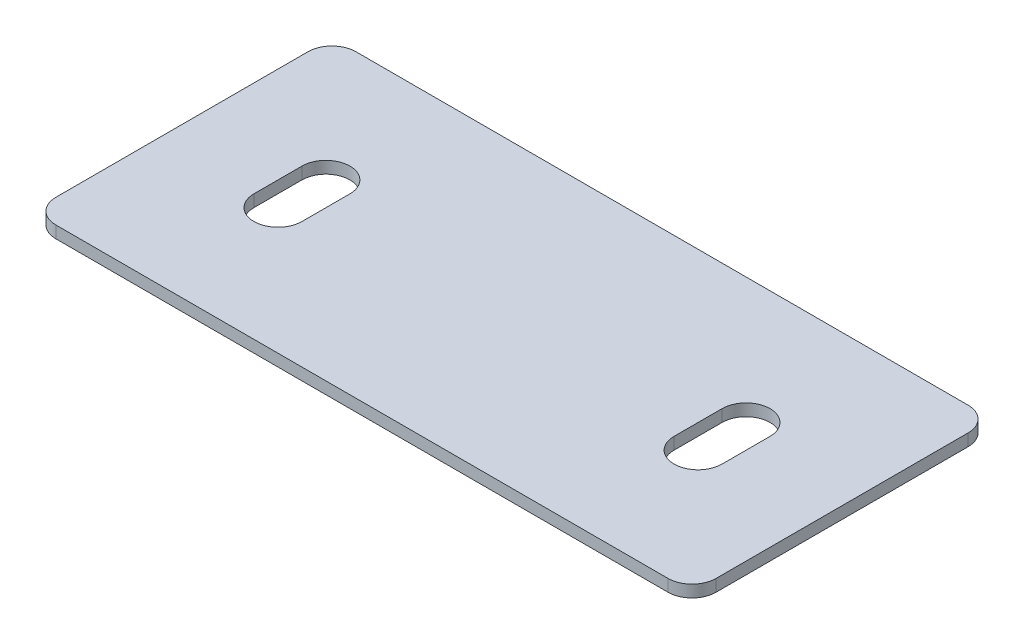
ISO-10303-21;
HEADER;
FILE_DESCRIPTION(('STEP AP214'),'2;1');
FILE_NAME('part.step','',(''),(''),'','','');
FILE_SCHEMA(('AUTOMOTIVE_DESIGN { 1 0 10303 214 1 1 1 1 }'));
ENDSEC;
DATA;
#1=APPLICATION_CONTEXT('core data for automotive mechanical design processes');
#2=APPLICATION_PROTOCOL_DEFINITION('international standard','automotive_design',2000,#1);
#3=PRODUCT_CONTEXT('',#1,'mechanical');
#4=PRODUCT('Part','Part','',(#3));
#5=PRODUCT_RELATED_PRODUCT_CATEGORY('part','',(#4));
#6=PRODUCT_DEFINITION_FORMATION('','',#4);
#7=PRODUCT_DEFINITION_CONTEXT('part definition',#1,'design');
#8=PRODUCT_DEFINITION('design','',#6,#7);
#9=PRODUCT_DEFINITION_SHAPE('','',#8);
#10=(LENGTH_UNIT() NAMED_UNIT(*) SI_UNIT(.MILLI.,.METRE.));
#11=(NAMED_UNIT(*) PLANE_ANGLE_UNIT() SI_UNIT($,.RADIAN.));
#12=(NAMED_UNIT(*) SI_UNIT($,.STERADIAN.) SOLID_ANGLE_UNIT());
#13=UNCERTAINTY_MEASURE_WITH_UNIT(LENGTH_MEASURE(1.E-05),#10,'distance_accuracy_value','');
#14=(GEOMETRIC_REPRESENTATION_CONTEXT(3) GLOBAL_UNCERTAINTY_ASSIGNED_CONTEXT((#13)) GLOBAL_UNIT_ASSIGNED_CONTEXT((#10,
#11,#12)) REPRESENTATION_CONTEXT('',''));
#15=CARTESIAN_POINT('',(0.,0.,0.));
#16=DIRECTION('',(0.,0.,1.));
#17=DIRECTION('',(1.,0.,0.));
#18=AXIS2_PLACEMENT_3D('',#15,#16,#17);
#19=CARTESIAN_POINT('',(0.,1.,0.));
#20=DIRECTION('',(0.,1.,0.));
#21=DIRECTION('',(0.,0.,1.));
#22=AXIS2_PLACEMENT_3D('',#19,#20,#21);
#23=PLANE('',#22);
#24=DIRECTION('',(0.,0.,1.));
#25=VECTOR('',#24,1.);
#26=CARTESIAN_POINT('',(-30.2182697593582,1.,-12.7126572133864));
#27=LINE('',#26,#25);
#28=CARTESIAN_POINT('',(-30.2182697593582,1.,-10.7126572133864));
#29=VERTEX_POINT('',#28);
#30=CARTESIAN_POINT('',(-30.2182697593582,1.,10.2873427866136));
#31=VERTEX_POINT('',#30);
#32=EDGE_CURVE('E227',#29,#31,#27,.T.);
#33=ORIENTED_EDGE('',*,*,#32,.T.);
#34=CARTESIAN_POINT('',(-28.2182697593582,1.,10.2873427866136));
#35=DIRECTION('',(0.,1.,0.));
#36=DIRECTION('',(0.,0.,1.));
#37=AXIS2_PLACEMENT_3D('',#34,#35,#36);
#38=CIRCLE('',#37,2.);
#39=CARTESIAN_POINT('',(-28.2182697593582,1.,12.2873427866136));
#40=VERTEX_POINT('',#39);
#41=EDGE_CURVE('E265',#31,#40,#38,.T.);
#42=ORIENTED_EDGE('',*,*,#41,.T.);
#43=DIRECTION('',(1.,0.,0.));
#44=VECTOR('',#43,1.);
#45=CARTESIAN_POINT('',(-30.2182697593582,1.,12.2873427866136));
#46=LINE('',#45,#44);
#47=CARTESIAN_POINT('',(22.7817302406418,1.,12.2873427866136));
#48=VERTEX_POINT('',#47);
#49=EDGE_CURVE('E230',#40,#48,#46,.T.);
#50=ORIENTED_EDGE('',*,*,#49,.T.);
#51=CARTESIAN_POINT('',(22.7817302406418,1.,10.2873427866136));
#52=DIRECTION('',(0.,1.,0.));
#53=DIRECTION('',(0.,0.,1.));
#54=AXIS2_PLACEMENT_3D('',#51,#52,#53);
#55=CIRCLE('',#54,2.);
#56=CARTESIAN_POINT('',(24.7817302406418,1.,10.2873427866136));
#57=VERTEX_POINT('',#56);
#58=EDGE_CURVE('E260',#48,#57,#55,.T.);
#59=ORIENTED_EDGE('',*,*,#58,.T.);
#60=DIRECTION('',(0.,0.,-1.));
#61=VECTOR('',#60,1.);
#62=CARTESIAN_POINT('',(24.7817302406418,1.,-12.7126572133864));
#63=LINE('',#62,#61);
#64=CARTESIAN_POINT('',(24.7817302406418,1.,-10.7126572133864));
#65=VERTEX_POINT('',#64);
#66=EDGE_CURVE('E222',#57,#65,#63,.T.);
#67=ORIENTED_EDGE('',*,*,#66,.T.);
#68=CARTESIAN_POINT('',(22.7817302406418,1.,-10.7126572133864));
#69=DIRECTION('',(0.,1.,0.));
#70=DIRECTION('',(0.,0.,1.));
#71=AXIS2_PLACEMENT_3D('',#68,#69,#70);
#72=CIRCLE('',#71,2.);
#73=CARTESIAN_POINT('',(22.7817302406418,1.,-12.7126572133864));
#74=VERTEX_POINT('',#73);
#75=EDGE_CURVE('E57',#65,#74,#72,.T.);
#76=ORIENTED_EDGE('',*,*,#75,.T.);
#77=DIRECTION('',(-1.,0.,0.));
#78=VECTOR('',#77,1.);
#79=CARTESIAN_POINT('',(-30.2182697593582,1.,-12.7126572133864));
#80=LINE('',#79,#78);
#81=CARTESIAN_POINT('',(-28.2182697593582,1.,-12.7126572133864));
#82=VERTEX_POINT('',#81);
#83=EDGE_CURVE('E224',#74,#82,#80,.T.);
#84=ORIENTED_EDGE('',*,*,#83,.T.);
#85=CARTESIAN_POINT('',(-28.2182697593582,1.,-10.7126572133864));
#86=DIRECTION('',(0.,1.,0.));
#87=DIRECTION('',(0.,0.,1.));
#88=AXIS2_PLACEMENT_3D('',#85,#86,#87);
#89=CIRCLE('',#88,2.);
#90=EDGE_CURVE('E263',#82,#29,#89,.T.);
#91=ORIENTED_EDGE('',*,*,#90,.T.);
#92=EDGE_LOOP('',(#33,#42,#50,#59,#67,#76,#84,#91));
#93=FACE_BOUND('',#92,.T.);
#94=DIRECTION('',(0.,0.,1.));
#95=VECTOR('',#94,1.);
#96=CARTESIAN_POINT('',(-22.2182697593582,1.,-2.21265721338636));
#97=LINE('',#96,#95);
#98=CARTESIAN_POINT('',(-22.2182697593582,1.,-2.21265721338636));
#99=VERTEX_POINT('',#98);
#100=CARTESIAN_POINT('',(-22.2182697593582,1.,1.78734278661363));
#101=VERTEX_POINT('',#100);
#102=EDGE_CURVE('E193',#99,#101,#97,.T.);
#103=ORIENTED_EDGE('',*,*,#102,.F.);
#104=CARTESIAN_POINT('',(-20.2182697593582,1.,-2.21265721338637));
#105=DIRECTION('',(0.,1.,0.));
#106=DIRECTION('',(0.,0.,1.));
#107=AXIS2_PLACEMENT_3D('',#104,#105,#106);
#108=CIRCLE('',#107,2.00000000000001);
#109=CARTESIAN_POINT('',(-18.2182697593582,1.,-2.21265721338637));
#110=VERTEX_POINT('',#109);
#111=EDGE_CURVE('E191',#110,#99,#108,.T.);
#112=ORIENTED_EDGE('',*,*,#111,.F.);
#113=DIRECTION('',(0.,0.,-1.));
#114=VECTOR('',#113,1.);
#115=CARTESIAN_POINT('',(-18.2182697593582,1.,-2.21265721338637));
#116=LINE('',#115,#114);
#117=CARTESIAN_POINT('',(-18.2182697593582,1.,1.78734278661364));
#118=VERTEX_POINT('',#117);
#119=EDGE_CURVE('E199',#118,#110,#116,.T.);
#120=ORIENTED_EDGE('',*,*,#119,.F.);
#121=CARTESIAN_POINT('',(-20.2182697593582,1.,1.78734278661365));
#122=DIRECTION('',(0.,1.,0.));
#123=DIRECTION('',(0.,0.,1.));
#124=AXIS2_PLACEMENT_3D('',#121,#122,#123);
#125=CIRCLE('',#124,2.00000000000001);
#126=EDGE_CURVE('E196',#101,#118,#125,.T.);
#127=ORIENTED_EDGE('',*,*,#126,.F.);
#128=EDGE_LOOP('',(#103,#112,#120,#127));
#129=FACE_BOUND('',#128,.T.);
#130=DIRECTION('',(0.,0.,1.));
#131=VECTOR('',#130,1.);
#132=CARTESIAN_POINT('',(12.7817302406417,1.,-2.21265721338637));
#133=LINE('',#132,#131);
#134=CARTESIAN_POINT('',(12.7817302406417,1.,-2.21265721338637));
#135=VERTEX_POINT('',#134);
#136=CARTESIAN_POINT('',(12.7817302406417,1.,1.78734278661363));
#137=VERTEX_POINT('',#136);
#138=EDGE_CURVE('E160',#135,#137,#133,.T.);
#139=ORIENTED_EDGE('',*,*,#138,.F.);
#140=CARTESIAN_POINT('',(14.7817302406418,1.,-2.21265721338637));
#141=DIRECTION('',(0.,1.,0.));
#142=DIRECTION('',(0.,0.,-1.));
#143=AXIS2_PLACEMENT_3D('',#140,#141,#142);
#144=CIRCLE('',#143,2.00000000000001);
#145=CARTESIAN_POINT('',(16.7817302406418,1.,-2.21265721338637));
#146=VERTEX_POINT('',#145);
#147=EDGE_CURVE('E150',#146,#135,#144,.T.);
#148=ORIENTED_EDGE('',*,*,#147,.F.);
#149=DIRECTION('',(0.,0.,-1.));
#150=VECTOR('',#149,1.);
#151=CARTESIAN_POINT('',(16.7817302406418,1.,-2.21265721338637));
#152=LINE('',#151,#150);
#153=CARTESIAN_POINT('',(16.7817302406418,1.,1.78734278661363));
#154=VERTEX_POINT('',#153);
#155=EDGE_CURVE('E175',#154,#146,#152,.T.);
#156=ORIENTED_EDGE('',*,*,#155,.F.);
#157=CARTESIAN_POINT('',(14.7817302406418,1.,1.78734278661363));
#158=DIRECTION('',(0.,1.,0.));
#159=DIRECTION('',(0.,0.,-1.));
#160=AXIS2_PLACEMENT_3D('',#157,#158,#159);
#161=CIRCLE('',#160,2.00000000000001);
#162=EDGE_CURVE('E173',#137,#154,#161,.T.);
#163=ORIENTED_EDGE('',*,*,#162,.F.);
#164=EDGE_LOOP('',(#139,#148,#156,#163));
#165=FACE_BOUND('',#164,.T.);
#166=ADVANCED_FACE('F35',(#93,#129,#165),#23,.T.);
#167=CARTESIAN_POINT('',(0.,0.,0.));
#168=DIRECTION('',(0.,1.,0.));
#169=DIRECTION('',(0.,0.,1.));
#170=AXIS2_PLACEMENT_3D('',#167,#168,#169);
#171=PLANE('',#170);
#172=CARTESIAN_POINT('',(-20.2182697593582,0.,-2.21265721338637));
#173=DIRECTION('',(0.,1.,0.));
#174=DIRECTION('',(0.,0.,1.));
#175=AXIS2_PLACEMENT_3D('',#172,#173,#174);
#176=CIRCLE('',#175,2.00000000000001);
#177=CARTESIAN_POINT('',(-18.2182697593582,0.,-2.21265721338637));
#178=VERTEX_POINT('',#177);
#179=CARTESIAN_POINT('',(-22.2182697593582,0.,-2.21265721338636));
#180=VERTEX_POINT('',#179);
#181=EDGE_CURVE('E168',#178,#180,#176,.T.);
#182=ORIENTED_EDGE('',*,*,#181,.T.);
#183=DIRECTION('',(0.,0.,1.));
#184=VECTOR('',#183,1.);
#185=CARTESIAN_POINT('',(-22.2182697593582,0.,-2.21265721338636));
#186=LINE('',#185,#184);
#187=CARTESIAN_POINT('',(-22.2182697593582,0.,1.78734278661363));
#188=VERTEX_POINT('',#187);
#189=EDGE_CURVE('E204',#180,#188,#186,.T.);
#190=ORIENTED_EDGE('',*,*,#189,.T.);
#191=CARTESIAN_POINT('',(-20.2182697593582,0.,1.78734278661365));
#192=DIRECTION('',(0.,1.,0.));
#193=DIRECTION('',(0.,0.,1.));
#194=AXIS2_PLACEMENT_3D('',#191,#192,#193);
#195=CIRCLE('',#194,2.00000000000001);
#196=CARTESIAN_POINT('',(-18.2182697593582,0.,1.78734278661364));
#197=VERTEX_POINT('',#196);
#198=EDGE_CURVE('E207',#188,#197,#195,.T.);
#199=ORIENTED_EDGE('',*,*,#198,.T.);
#200=DIRECTION('',(0.,0.,-1.));
#201=VECTOR('',#200,1.);
#202=CARTESIAN_POINT('',(-18.2182697593582,0.,-2.21265721338637));
#203=LINE('',#202,#201);
#204=EDGE_CURVE('E194',#197,#178,#203,.T.);
#205=ORIENTED_EDGE('',*,*,#204,.T.);
#206=EDGE_LOOP('',(#182,#190,#199,#205));
#207=FACE_BOUND('',#206,.T.);
#208=DIRECTION('',(1.,0.,0.));
#209=VECTOR('',#208,1.);
#210=CARTESIAN_POINT('',(-30.2182697593582,0.,12.2873427866136));
#211=LINE('',#210,#209);
#212=CARTESIAN_POINT('',(-28.2182697593582,0.,12.2873427866136));
#213=VERTEX_POINT('',#212);
#214=CARTESIAN_POINT('',(22.7817302406418,0.,12.2873427866136));
#215=VERTEX_POINT('',#214);
#216=EDGE_CURVE('E225',#213,#215,#211,.T.);
#217=ORIENTED_EDGE('',*,*,#216,.F.);
#218=CARTESIAN_POINT('',(-28.2182697593582,0.,10.2873427866136));
#219=DIRECTION('',(0.,1.,0.));
#220=DIRECTION('',(0.,0.,1.));
#221=AXIS2_PLACEMENT_3D('',#218,#219,#220);
#222=CIRCLE('',#221,2.);
#223=CARTESIAN_POINT('',(-30.2182697593582,0.,10.2873427866136));
#224=VERTEX_POINT('',#223);
#225=EDGE_CURVE('E253',#213,#224,#222,.F.);
#226=ORIENTED_EDGE('',*,*,#225,.T.);
#227=DIRECTION('',(0.,0.,1.));
#228=VECTOR('',#227,1.);
#229=CARTESIAN_POINT('',(-30.2182697593582,0.,-12.7126572133864));
#230=LINE('',#229,#228);
#231=CARTESIAN_POINT('',(-30.2182697593582,0.,-10.7126572133864));
#232=VERTEX_POINT('',#231);
#233=EDGE_CURVE('E238',#232,#224,#230,.T.);
#234=ORIENTED_EDGE('',*,*,#233,.F.);
#235=CARTESIAN_POINT('',(-28.2182697593582,0.,-10.7126572133864));
#236=DIRECTION('',(0.,1.,0.));
#237=DIRECTION('',(0.,0.,1.));
#238=AXIS2_PLACEMENT_3D('',#235,#236,#237);
#239=CIRCLE('',#238,2.);
#240=CARTESIAN_POINT('',(-28.2182697593582,0.,-12.7126572133864));
#241=VERTEX_POINT('',#240);
#242=EDGE_CURVE('E251',#232,#241,#239,.F.);
#243=ORIENTED_EDGE('',*,*,#242,.T.);
#244=DIRECTION('',(-1.,0.,0.));
#245=VECTOR('',#244,1.);
#246=CARTESIAN_POINT('',(-30.2182697593582,0.,-12.7126572133864));
#247=LINE('',#246,#245);
#248=CARTESIAN_POINT('',(22.7817302406418,0.,-12.7126572133864));
#249=VERTEX_POINT('',#248);
#250=EDGE_CURVE('E236',#249,#241,#247,.T.);
#251=ORIENTED_EDGE('',*,*,#250,.F.);
#252=CARTESIAN_POINT('',(22.7817302406418,0.,-10.7126572133864));
#253=DIRECTION('',(0.,1.,0.));
#254=DIRECTION('',(0.,0.,1.));
#255=AXIS2_PLACEMENT_3D('',#252,#253,#254);
#256=CIRCLE('',#255,2.);
#257=CARTESIAN_POINT('',(24.7817302406418,0.,-10.7126572133864));
#258=VERTEX_POINT('',#257);
#259=EDGE_CURVE('E249',#249,#258,#256,.F.);
#260=ORIENTED_EDGE('',*,*,#259,.T.);
#261=DIRECTION('',(0.,0.,-1.));
#262=VECTOR('',#261,1.);
#263=CARTESIAN_POINT('',(24.7817302406418,0.,-12.7126572133864));
#264=LINE('',#263,#262);
#265=CARTESIAN_POINT('',(24.7817302406418,0.,10.2873427866136));
#266=VERTEX_POINT('',#265);
#267=EDGE_CURVE('E221',#266,#258,#264,.T.);
#268=ORIENTED_EDGE('',*,*,#267,.F.);
#269=CARTESIAN_POINT('',(22.7817302406418,0.,10.2873427866136));
#270=DIRECTION('',(0.,1.,0.));
#271=DIRECTION('',(0.,0.,1.));
#272=AXIS2_PLACEMENT_3D('',#269,#270,#271);
#273=CIRCLE('',#272,2.);
#274=EDGE_CURVE('E247',#266,#215,#273,.F.);
#275=ORIENTED_EDGE('',*,*,#274,.T.);
#276=EDGE_LOOP('',(#217,#226,#234,#243,#251,#260,#268,#275));
#277=FACE_BOUND('',#276,.T.);
#278=CARTESIAN_POINT('',(14.7817302406418,0.,-2.21265721338637));
#279=DIRECTION('',(0.,1.,0.));
#280=DIRECTION('',(0.,0.,-1.));
#281=AXIS2_PLACEMENT_3D('',#278,#279,#280);
#282=CIRCLE('',#281,2.00000000000001);
#283=CARTESIAN_POINT('',(16.7817302406418,0.,-2.21265721338637));
#284=VERTEX_POINT('',#283);
#285=CARTESIAN_POINT('',(12.7817302406417,0.,-2.21265721338637));
#286=VERTEX_POINT('',#285);
#287=EDGE_CURVE('E179',#284,#286,#282,.T.);
#288=ORIENTED_EDGE('',*,*,#287,.T.);
#289=DIRECTION('',(0.,0.,1.));
#290=VECTOR('',#289,1.);
#291=CARTESIAN_POINT('',(12.7817302406417,0.,-2.21265721338637));
#292=LINE('',#291,#290);
#293=CARTESIAN_POINT('',(12.7817302406417,0.,1.78734278661363));
#294=VERTEX_POINT('',#293);
#295=EDGE_CURVE('E167',#286,#294,#292,.T.);
#296=ORIENTED_EDGE('',*,*,#295,.T.);
#297=CARTESIAN_POINT('',(14.7817302406418,0.,1.78734278661363));
#298=DIRECTION('',(0.,1.,0.));
#299=DIRECTION('',(0.,0.,-1.));
#300=AXIS2_PLACEMENT_3D('',#297,#298,#299);
#301=CIRCLE('',#300,2.00000000000001);
#302=CARTESIAN_POINT('',(16.7817302406418,0.,1.78734278661363));
#303=VERTEX_POINT('',#302);
#304=EDGE_CURVE('E182',#294,#303,#301,.T.);
#305=ORIENTED_EDGE('',*,*,#304,.T.);
#306=DIRECTION('',(0.,0.,-1.));
#307=VECTOR('',#306,1.);
#308=CARTESIAN_POINT('',(16.7817302406418,0.,-2.21265721338637));
#309=LINE('',#308,#307);
#310=EDGE_CURVE('E161',#303,#284,#309,.T.);
#311=ORIENTED_EDGE('',*,*,#310,.T.);
#312=EDGE_LOOP('',(#288,#296,#305,#311));
#313=FACE_BOUND('',#312,.T.);
#314=ADVANCED_FACE('F281',(#207,#277,#313),#171,.F.);
#315=CARTESIAN_POINT('',(24.7817302406418,1.,-12.7126572133864));
#316=DIRECTION('',(-1.,0.,0.));
#317=DIRECTION('',(0.,0.,1.));
#318=AXIS2_PLACEMENT_3D('',#315,#316,#317);
#319=PLANE('',#318);
#320=ORIENTED_EDGE('',*,*,#267,.T.);
#321=DIRECTION('',(0.,-1.,0.));
#322=VECTOR('',#321,1.);
#323=CARTESIAN_POINT('',(24.7817302406418,1.,-10.7126572133864));
#324=LINE('',#323,#322);
#325=EDGE_CURVE('E11',#258,#65,#324,.F.);
#326=ORIENTED_EDGE('',*,*,#325,.T.);
#327=ORIENTED_EDGE('',*,*,#66,.F.);
#328=DIRECTION('',(0.,-1.,0.));
#329=VECTOR('',#328,1.);
#330=CARTESIAN_POINT('',(24.7817302406418,1.,10.2873427866136));
#331=LINE('',#330,#329);
#332=EDGE_CURVE('E43',#57,#266,#331,.T.);
#333=ORIENTED_EDGE('',*,*,#332,.T.);
#334=EDGE_LOOP('',(#320,#326,#327,#333));
#335=FACE_BOUND('',#334,.T.);
#336=ADVANCED_FACE('F275',(#335),#319,.F.);
#337=CARTESIAN_POINT('',(-30.2182697593582,1.,-12.7126572133864));
#338=DIRECTION('',(0.,0.,1.));
#339=DIRECTION('',(1.,0.,0.));
#340=AXIS2_PLACEMENT_3D('',#337,#338,#339);
#341=PLANE('',#340);
#342=ORIENTED_EDGE('',*,*,#250,.T.);
#343=DIRECTION('',(0.,-1.,0.));
#344=VECTOR('',#343,1.);
#345=CARTESIAN_POINT('',(-28.2182697593582,1.,-12.7126572133864));
#346=LINE('',#345,#344);
#347=EDGE_CURVE('E50',#241,#82,#346,.F.);
#348=ORIENTED_EDGE('',*,*,#347,.T.);
#349=ORIENTED_EDGE('',*,*,#83,.F.);
#350=DIRECTION('',(0.,-1.,0.));
#351=VECTOR('',#350,1.);
#352=CARTESIAN_POINT('',(22.7817302406418,1.,-12.7126572133864));
#353=LINE('',#352,#351);
#354=EDGE_CURVE('E267',#74,#249,#353,.T.);
#355=ORIENTED_EDGE('',*,*,#354,.T.);
#356=EDGE_LOOP('',(#342,#348,#349,#355));
#357=FACE_BOUND('',#356,.T.);
#358=ADVANCED_FACE('F287',(#357),#341,.F.);
#359=CARTESIAN_POINT('',(-30.2182697593582,1.,-12.7126572133864));
#360=DIRECTION('',(1.,0.,0.));
#361=DIRECTION('',(0.,0.,-1.));
#362=AXIS2_PLACEMENT_3D('',#359,#360,#361);
#363=PLANE('',#362);
#364=ORIENTED_EDGE('',*,*,#233,.T.);
#365=DIRECTION('',(0.,-1.,0.));
#366=VECTOR('',#365,1.);
#367=CARTESIAN_POINT('',(-30.2182697593582,1.,10.2873427866136));
#368=LINE('',#367,#366);
#369=EDGE_CURVE('E258',#224,#31,#368,.F.);
#370=ORIENTED_EDGE('',*,*,#369,.T.);
#371=ORIENTED_EDGE('',*,*,#32,.F.);
#372=DIRECTION('',(0.,-1.,0.));
#373=VECTOR('',#372,1.);
#374=CARTESIAN_POINT('',(-30.2182697593582,1.,-10.7126572133864));
#375=LINE('',#374,#373);
#376=EDGE_CURVE('E255',#29,#232,#375,.T.);
#377=ORIENTED_EDGE('',*,*,#376,.T.);
#378=EDGE_LOOP('',(#364,#370,#371,#377));
#379=FACE_BOUND('',#378,.T.);
#380=ADVANCED_FACE('F296',(#379),#363,.F.);
#381=CARTESIAN_POINT('',(-30.2182697593582,1.,12.2873427866136));
#382=DIRECTION('',(0.,0.,-1.));
#383=DIRECTION('',(-1.,0.,0.));
#384=AXIS2_PLACEMENT_3D('',#381,#382,#383);
#385=PLANE('',#384);
#386=ORIENTED_EDGE('',*,*,#49,.F.);
#387=DIRECTION('',(0.,-1.,0.));
#388=VECTOR('',#387,1.);
#389=CARTESIAN_POINT('',(-28.2182697593582,1.,12.2873427866136));
#390=LINE('',#389,#388);
#391=EDGE_CURVE('E244',#40,#213,#390,.T.);
#392=ORIENTED_EDGE('',*,*,#391,.T.);
#393=ORIENTED_EDGE('',*,*,#216,.T.);
#394=DIRECTION('',(0.,-1.,0.));
#395=VECTOR('',#394,1.);
#396=CARTESIAN_POINT('',(22.7817302406418,1.,12.2873427866136));
#397=LINE('',#396,#395);
#398=EDGE_CURVE('E233',#215,#48,#397,.F.);
#399=ORIENTED_EDGE('',*,*,#398,.T.);
#400=EDGE_LOOP('',(#386,#392,#393,#399));
#401=FACE_BOUND('',#400,.T.);
#402=ADVANCED_FACE('F304',(#401),#385,.F.);
#403=CARTESIAN_POINT('',(-20.2182697593582,1.,-2.21265721338637));
#404=DIRECTION('',(0.,-1.,0.));
#405=DIRECTION('',(0.,0.,-1.));
#406=AXIS2_PLACEMENT_3D('',#403,#404,#405);
#407=CYLINDRICAL_SURFACE('',#406,2.00000000000001);
#408=ORIENTED_EDGE('',*,*,#181,.F.);
#409=DIRECTION('',(0.,-1.,0.));
#410=VECTOR('',#409,1.);
#411=CARTESIAN_POINT('',(-18.2182697593582,1.,-2.21265721338637));
#412=LINE('',#411,#410);
#413=EDGE_CURVE('E201',#110,#178,#412,.T.);
#414=ORIENTED_EDGE('',*,*,#413,.F.);
#415=ORIENTED_EDGE('',*,*,#111,.T.);
#416=DIRECTION('',(0.,-1.,0.));
#417=VECTOR('',#416,1.);
#418=CARTESIAN_POINT('',(-22.2182697593582,1.,-2.21265721338636));
#419=LINE('',#418,#417);
#420=EDGE_CURVE('E218',#99,#180,#419,.T.);
#421=ORIENTED_EDGE('',*,*,#420,.T.);
#422=EDGE_LOOP('',(#408,#414,#415,#421));
#423=FACE_BOUND('',#422,.T.);
#424=ADVANCED_FACE('F318',(#423),#407,.F.);
#425=CARTESIAN_POINT('',(-22.2182697593582,1.,-2.21265721338636));
#426=DIRECTION('',(1.,0.,0.));
#427=DIRECTION('',(0.,0.,-1.));
#428=AXIS2_PLACEMENT_3D('',#425,#426,#427);
#429=PLANE('',#428);
#430=ORIENTED_EDGE('',*,*,#189,.F.);
#431=ORIENTED_EDGE('',*,*,#420,.F.);
#432=ORIENTED_EDGE('',*,*,#102,.T.);
#433=DIRECTION('',(0.,-1.,0.));
#434=VECTOR('',#433,1.);
#435=CARTESIAN_POINT('',(-22.2182697593582,1.,1.78734278661363));
#436=LINE('',#435,#434);
#437=EDGE_CURVE('E216',#101,#188,#436,.T.);
#438=ORIENTED_EDGE('',*,*,#437,.T.);
#439=EDGE_LOOP('',(#430,#431,#432,#438));
#440=FACE_BOUND('',#439,.T.);
#441=ADVANCED_FACE('F403',(#440),#429,.T.);
#442=CARTESIAN_POINT('',(-20.2182697593582,1.,1.78734278661365));
#443=DIRECTION('',(0.,-1.,0.));
#444=DIRECTION('',(0.,0.,-1.));
#445=AXIS2_PLACEMENT_3D('',#442,#443,#444);
#446=CYLINDRICAL_SURFACE('',#445,2.00000000000001);
#447=ORIENTED_EDGE('',*,*,#198,.F.);
#448=ORIENTED_EDGE('',*,*,#437,.F.);
#449=ORIENTED_EDGE('',*,*,#126,.T.);
#450=DIRECTION('',(0.,-1.,0.));
#451=VECTOR('',#450,1.);
#452=CARTESIAN_POINT('',(-18.2182697593582,1.,1.78734278661364));
#453=LINE('',#452,#451);
#454=EDGE_CURVE('E214',#118,#197,#453,.T.);
#455=ORIENTED_EDGE('',*,*,#454,.T.);
#456=EDGE_LOOP('',(#447,#448,#449,#455));
#457=FACE_BOUND('',#456,.T.);
#458=ADVANCED_FACE('F394',(#457),#446,.F.);
#459=CARTESIAN_POINT('',(-18.2182697593582,1.,-2.21265721338637));
#460=DIRECTION('',(-1.,0.,0.));
#461=DIRECTION('',(0.,0.,1.));
#462=AXIS2_PLACEMENT_3D('',#459,#460,#461);
#463=PLANE('',#462);
#464=ORIENTED_EDGE('',*,*,#204,.F.);
#465=ORIENTED_EDGE('',*,*,#454,.F.);
#466=ORIENTED_EDGE('',*,*,#119,.T.);
#467=ORIENTED_EDGE('',*,*,#413,.T.);
#468=EDGE_LOOP('',(#464,#465,#466,#467));
#469=FACE_BOUND('',#468,.T.);
#470=ADVANCED_FACE('F386',(#469),#463,.T.);
#471=CARTESIAN_POINT('',(14.7817302406418,1.,-2.21265721338637));
#472=DIRECTION('',(0.,-1.,0.));
#473=DIRECTION('',(0.,0.,-1.));
#474=AXIS2_PLACEMENT_3D('',#471,#472,#473);
#475=CYLINDRICAL_SURFACE('',#474,2.00000000000001);
#476=ORIENTED_EDGE('',*,*,#287,.F.);
#477=DIRECTION('',(0.,-1.,0.));
#478=VECTOR('',#477,1.);
#479=CARTESIAN_POINT('',(16.7817302406418,1.,-2.21265721338637));
#480=LINE('',#479,#478);
#481=EDGE_CURVE('E156',#146,#284,#480,.T.);
#482=ORIENTED_EDGE('',*,*,#481,.F.);
#483=ORIENTED_EDGE('',*,*,#147,.T.);
#484=DIRECTION('',(0.,-1.,0.));
#485=VECTOR('',#484,1.);
#486=CARTESIAN_POINT('',(12.7817302406417,1.,-2.21265721338637));
#487=LINE('',#486,#485);
#488=EDGE_CURVE('E153',#135,#286,#487,.T.);
#489=ORIENTED_EDGE('',*,*,#488,.T.);
#490=EDGE_LOOP('',(#476,#482,#483,#489));
#491=FACE_BOUND('',#490,.T.);
#492=ADVANCED_FACE('F152',(#491),#475,.F.);
#493=CARTESIAN_POINT('',(12.7817302406417,1.,-2.21265721338637));
#494=DIRECTION('',(1.,0.,0.));
#495=DIRECTION('',(0.,0.,-1.));
#496=AXIS2_PLACEMENT_3D('',#493,#494,#495);
#497=PLANE('',#496);
#498=ORIENTED_EDGE('',*,*,#295,.F.);
#499=ORIENTED_EDGE('',*,*,#488,.F.);
#500=ORIENTED_EDGE('',*,*,#138,.T.);
#501=DIRECTION('',(0.,-1.,0.));
#502=VECTOR('',#501,1.);
#503=CARTESIAN_POINT('',(12.7817302406417,1.,1.78734278661363));
#504=LINE('',#503,#502);
#505=EDGE_CURVE('E169',#137,#294,#504,.T.);
#506=ORIENTED_EDGE('',*,*,#505,.T.);
#507=EDGE_LOOP('',(#498,#499,#500,#506));
#508=FACE_BOUND('',#507,.T.);
#509=ADVANCED_FACE('F164',(#508),#497,.T.);
#510=CARTESIAN_POINT('',(14.7817302406418,1.,1.78734278661363));
#511=DIRECTION('',(0.,-1.,0.));
#512=DIRECTION('',(0.,0.,-1.));
#513=AXIS2_PLACEMENT_3D('',#510,#511,#512);
#514=CYLINDRICAL_SURFACE('',#513,2.00000000000001);
#515=ORIENTED_EDGE('',*,*,#304,.F.);
#516=ORIENTED_EDGE('',*,*,#505,.F.);
#517=ORIENTED_EDGE('',*,*,#162,.T.);
#518=DIRECTION('',(0.,-1.,0.));
#519=VECTOR('',#518,1.);
#520=CARTESIAN_POINT('',(16.7817302406418,1.,1.78734278661363));
#521=LINE('',#520,#519);
#522=EDGE_CURVE('E188',#154,#303,#521,.T.);
#523=ORIENTED_EDGE('',*,*,#522,.T.);
#524=EDGE_LOOP('',(#515,#516,#517,#523));
#525=FACE_BOUND('',#524,.T.);
#526=ADVANCED_FACE('F362',(#525),#514,.F.);
#527=CARTESIAN_POINT('',(16.7817302406418,1.,-2.21265721338637));
#528=DIRECTION('',(-1.,0.,0.));
#529=DIRECTION('',(0.,0.,1.));
#530=AXIS2_PLACEMENT_3D('',#527,#528,#529);
#531=PLANE('',#530);
#532=ORIENTED_EDGE('',*,*,#310,.F.);
#533=ORIENTED_EDGE('',*,*,#522,.F.);
#534=ORIENTED_EDGE('',*,*,#155,.T.);
#535=ORIENTED_EDGE('',*,*,#481,.T.);
#536=EDGE_LOOP('',(#532,#533,#534,#535));
#537=FACE_BOUND('',#536,.T.);
#538=ADVANCED_FACE('F331',(#537),#531,.T.);
#539=CARTESIAN_POINT('',(-28.2182697593582,1.,10.2873427866136));
#540=DIRECTION('',(0.,-1.,0.));
#541=DIRECTION('',(0.,0.,-1.));
#542=AXIS2_PLACEMENT_3D('',#539,#540,#541);
#543=CYLINDRICAL_SURFACE('',#542,2.);
#544=ORIENTED_EDGE('',*,*,#41,.F.);
#545=ORIENTED_EDGE('',*,*,#369,.F.);
#546=ORIENTED_EDGE('',*,*,#225,.F.);
#547=ORIENTED_EDGE('',*,*,#391,.F.);
#548=EDGE_LOOP('',(#544,#545,#546,#547));
#549=FACE_BOUND('',#548,.T.);
#550=ADVANCED_FACE('F301',(#549),#543,.T.);
#551=CARTESIAN_POINT('',(-28.2182697593582,1.,-10.7126572133864));
#552=DIRECTION('',(0.,-1.,0.));
#553=DIRECTION('',(0.,0.,-1.));
#554=AXIS2_PLACEMENT_3D('',#551,#552,#553);
#555=CYLINDRICAL_SURFACE('',#554,2.);
#556=ORIENTED_EDGE('',*,*,#90,.F.);
#557=ORIENTED_EDGE('',*,*,#347,.F.);
#558=ORIENTED_EDGE('',*,*,#242,.F.);
#559=ORIENTED_EDGE('',*,*,#376,.F.);
#560=EDGE_LOOP('',(#556,#557,#558,#559));
#561=FACE_BOUND('',#560,.T.);
#562=ADVANCED_FACE('F293',(#561),#555,.T.);
#563=CARTESIAN_POINT('',(22.7817302406418,1.,-10.7126572133864));
#564=DIRECTION('',(0.,-1.,0.));
#565=DIRECTION('',(0.,0.,-1.));
#566=AXIS2_PLACEMENT_3D('',#563,#564,#565);
#567=CYLINDRICAL_SURFACE('',#566,2.);
#568=ORIENTED_EDGE('',*,*,#75,.F.);
#569=ORIENTED_EDGE('',*,*,#325,.F.);
#570=ORIENTED_EDGE('',*,*,#259,.F.);
#571=ORIENTED_EDGE('',*,*,#354,.F.);
#572=EDGE_LOOP('',(#568,#569,#570,#571));
#573=FACE_BOUND('',#572,.T.);
#574=ADVANCED_FACE('F286',(#573),#567,.T.);
#575=CARTESIAN_POINT('',(22.7817302406418,1.,10.2873427866136));
#576=DIRECTION('',(0.,-1.,0.));
#577=DIRECTION('',(0.,0.,-1.));
#578=AXIS2_PLACEMENT_3D('',#575,#576,#577);
#579=CYLINDRICAL_SURFACE('',#578,2.);
#580=ORIENTED_EDGE('',*,*,#58,.F.);
#581=ORIENTED_EDGE('',*,*,#398,.F.);
#582=ORIENTED_EDGE('',*,*,#274,.F.);
#583=ORIENTED_EDGE('',*,*,#332,.F.);
#584=EDGE_LOOP('',(#580,#581,#582,#583));
#585=FACE_BOUND('',#584,.T.);
#586=ADVANCED_FACE('F37',(#585),#579,.T.);
#587=CLOSED_SHELL('',(#166,#314,#336,#358,#380,#402,#424,#441,#458,#470,#492,#509,#526,#538,
#550,#562,#574,#586));
#588=MANIFOLD_SOLID_BREP('B2',#587);
#589=ADVANCED_BREP_SHAPE_REPRESENTATION('',(#18,#588),#14);
#590=SHAPE_DEFINITION_REPRESENTATION(#9,#589);
ENDSEC;
END-ISO-10303-21;
